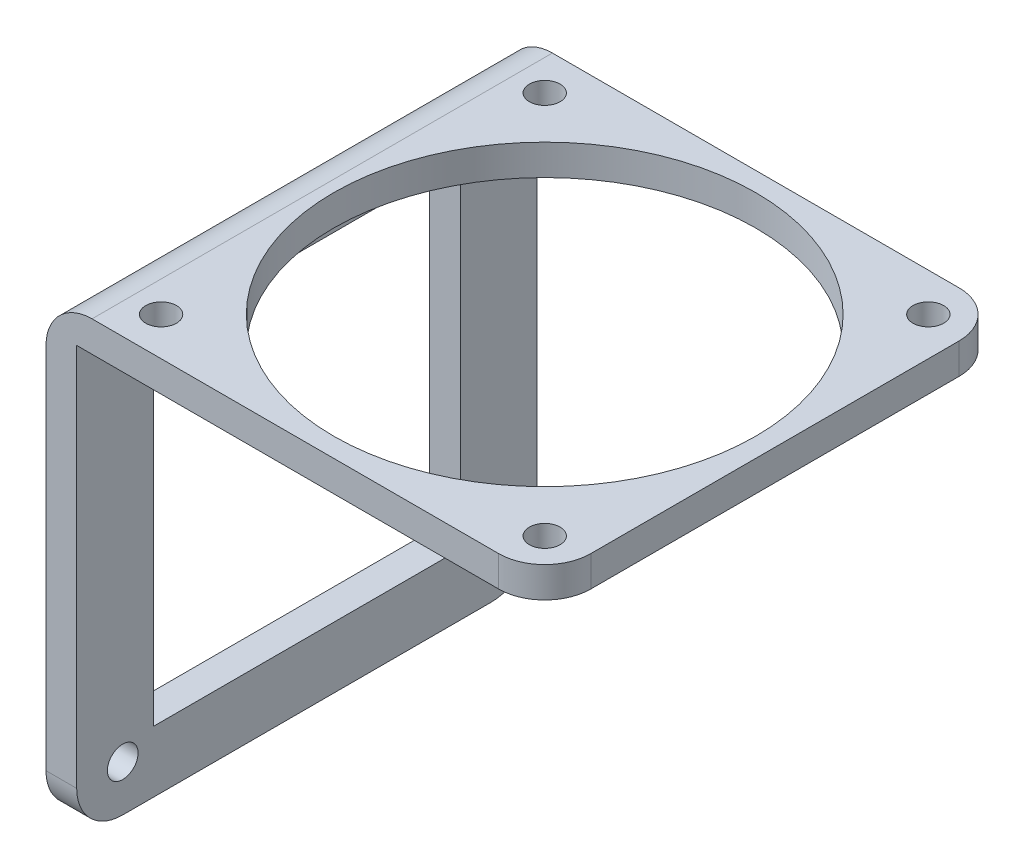
ISO-10303-21;
HEADER;
FILE_DESCRIPTION(('STEP AP214'),'2;1');
FILE_NAME('part.step','',(''),(''),'','','');
FILE_SCHEMA(('AUTOMOTIVE_DESIGN { 1 0 10303 214 1 1 1 1 }'));
ENDSEC;
DATA;
#1=APPLICATION_CONTEXT('core data for automotive mechanical design processes');
#2=APPLICATION_PROTOCOL_DEFINITION('international standard','automotive_design',2000,#1);
#3=PRODUCT_CONTEXT('',#1,'mechanical');
#4=PRODUCT('Part','Part','',(#3));
#5=PRODUCT_RELATED_PRODUCT_CATEGORY('part','',(#4));
#6=PRODUCT_DEFINITION_FORMATION('','',#4);
#7=PRODUCT_DEFINITION_CONTEXT('part definition',#1,'design');
#8=PRODUCT_DEFINITION('design','',#6,#7);
#9=PRODUCT_DEFINITION_SHAPE('','',#8);
#10=(LENGTH_UNIT() NAMED_UNIT(*) SI_UNIT(.MILLI.,.METRE.));
#11=(NAMED_UNIT(*) PLANE_ANGLE_UNIT() SI_UNIT($,.RADIAN.));
#12=(NAMED_UNIT(*) SI_UNIT($,.STERADIAN.) SOLID_ANGLE_UNIT());
#13=UNCERTAINTY_MEASURE_WITH_UNIT(LENGTH_MEASURE(1.E-05),#10,'distance_accuracy_value','');
#14=(GEOMETRIC_REPRESENTATION_CONTEXT(3) GLOBAL_UNCERTAINTY_ASSIGNED_CONTEXT((#13)) GLOBAL_UNIT_ASSIGNED_CONTEXT((#10,
#11,#12)) REPRESENTATION_CONTEXT('',''));
#15=CARTESIAN_POINT('',(0.,0.,0.));
#16=DIRECTION('',(0.,0.,1.));
#17=DIRECTION('',(1.,0.,0.));
#18=AXIS2_PLACEMENT_3D('',#15,#16,#17);
#19=CARTESIAN_POINT('',(0.,60.,60.));
#20=DIRECTION('',(1.,0.,0.));
#21=DIRECTION('',(0.,1.,0.));
#22=AXIS2_PLACEMENT_3D('',#19,#20,#21);
#23=PLANE('',#22);
#24=CARTESIAN_POINT('',(0.,6.,6.));
#25=DIRECTION('',(-1.,0.,0.));
#26=DIRECTION('',(0.,-1.,0.));
#27=AXIS2_PLACEMENT_3D('',#24,#25,#26);
#28=CIRCLE('',#27,2.);
#29=CARTESIAN_POINT('',(0.,4.,6.));
#30=VERTEX_POINT('',#29);
#31=EDGE_CURVE('E225',#30,#30,#28,.T.);
#32=ORIENTED_EDGE('',*,*,#31,.F.);
#33=EDGE_LOOP('',(#32));
#34=FACE_BOUND('',#33,.T.);
#35=CARTESIAN_POINT('',(0.,6.,54.));
#36=DIRECTION('',(-1.,0.,0.));
#37=DIRECTION('',(0.,-1.,0.));
#38=AXIS2_PLACEMENT_3D('',#35,#36,#37);
#39=CIRCLE('',#38,2.);
#40=CARTESIAN_POINT('',(0.,3.99999999999999,54.));
#41=VERTEX_POINT('',#40);
#42=EDGE_CURVE('E421',#41,#41,#39,.T.);
#43=ORIENTED_EDGE('',*,*,#42,.F.);
#44=EDGE_LOOP('',(#43));
#45=FACE_BOUND('',#44,.T.);
#46=DIRECTION('',(0.,0.,1.));
#47=VECTOR('',#46,1.);
#48=CARTESIAN_POINT('',(0.,8.,10.));
#49=LINE('',#48,#47);
#50=CARTESIAN_POINT('',(0.,8.,10.));
#51=VERTEX_POINT('',#50);
#52=CARTESIAN_POINT('',(0.,8.,50.));
#53=VERTEX_POINT('',#52);
#54=EDGE_CURVE('E157',#51,#53,#49,.T.);
#55=ORIENTED_EDGE('',*,*,#54,.F.);
#56=DIRECTION('',(0.,-1.,0.));
#57=VECTOR('',#56,1.);
#58=CARTESIAN_POINT('',(0.,8.,10.));
#59=LINE('',#58,#57);
#60=CARTESIAN_POINT('',(0.,51.9999999999998,10.));
#61=VERTEX_POINT('',#60);
#62=EDGE_CURVE('E162',#61,#51,#59,.T.);
#63=ORIENTED_EDGE('',*,*,#62,.F.);
#64=DIRECTION('',(0.,0.,-1.));
#65=VECTOR('',#64,1.);
#66=CARTESIAN_POINT('',(0.,51.9999999999998,10.));
#67=LINE('',#66,#65);
#68=CARTESIAN_POINT('',(0.,51.9999999999998,50.));
#69=VERTEX_POINT('',#68);
#70=EDGE_CURVE('E166',#69,#61,#67,.T.);
#71=ORIENTED_EDGE('',*,*,#70,.F.);
#72=DIRECTION('',(0.,1.,0.));
#73=VECTOR('',#72,1.);
#74=CARTESIAN_POINT('',(0.,8.,50.));
#75=LINE('',#74,#73);
#76=EDGE_CURVE('E146',#53,#69,#75,.T.);
#77=ORIENTED_EDGE('',*,*,#76,.F.);
#78=EDGE_LOOP('',(#55,#63,#71,#77));
#79=FACE_BOUND('',#78,.T.);
#80=DIRECTION('',(0.,-1.,0.));
#81=VECTOR('',#80,1.);
#82=CARTESIAN_POINT('',(0.,60.,60.));
#83=LINE('',#82,#81);
#84=CARTESIAN_POINT('',(0.,54.,60.));
#85=VERTEX_POINT('',#84);
#86=CARTESIAN_POINT('',(0.,6.,60.));
#87=VERTEX_POINT('',#86);
#88=EDGE_CURVE('E176',#85,#87,#83,.T.);
#89=ORIENTED_EDGE('',*,*,#88,.F.);
#90=DIRECTION('',(0.,0.,-1.));
#91=VECTOR('',#90,1.);
#92=CARTESIAN_POINT('',(0.,54.,60.));
#93=LINE('',#92,#91);
#94=CARTESIAN_POINT('',(0.,54.,0.));
#95=VERTEX_POINT('',#94);
#96=EDGE_CURVE('E261',#85,#95,#93,.T.);
#97=ORIENTED_EDGE('',*,*,#96,.T.);
#98=DIRECTION('',(0.,-1.,0.));
#99=VECTOR('',#98,1.);
#100=CARTESIAN_POINT('',(0.,60.,0.));
#101=LINE('',#100,#99);
#102=CARTESIAN_POINT('',(0.,6.,0.));
#103=VERTEX_POINT('',#102);
#104=EDGE_CURVE('E173',#95,#103,#101,.T.);
#105=ORIENTED_EDGE('',*,*,#104,.T.);
#106=CARTESIAN_POINT('',(0.,6.,6.));
#107=DIRECTION('',(1.,0.,0.));
#108=DIRECTION('',(0.,1.,0.));
#109=AXIS2_PLACEMENT_3D('',#106,#107,#108);
#110=CIRCLE('',#109,6.);
#111=CARTESIAN_POINT('',(0.,0.,6.));
#112=VERTEX_POINT('',#111);
#113=EDGE_CURVE('E257',#103,#112,#110,.F.);
#114=ORIENTED_EDGE('',*,*,#113,.T.);
#115=DIRECTION('',(0.,0.,-1.));
#116=VECTOR('',#115,1.);
#117=CARTESIAN_POINT('',(0.,0.,60.));
#118=LINE('',#117,#116);
#119=CARTESIAN_POINT('',(0.,0.,54.));
#120=VERTEX_POINT('',#119);
#121=EDGE_CURVE('E208',#120,#112,#118,.T.);
#122=ORIENTED_EDGE('',*,*,#121,.F.);
#123=CARTESIAN_POINT('',(0.,6.,54.));
#124=DIRECTION('',(1.,0.,0.));
#125=DIRECTION('',(0.,1.,0.));
#126=AXIS2_PLACEMENT_3D('',#123,#124,#125);
#127=CIRCLE('',#126,6.);
#128=EDGE_CURVE('E259',#120,#87,#127,.F.);
#129=ORIENTED_EDGE('',*,*,#128,.T.);
#130=EDGE_LOOP('',(#89,#97,#105,#114,#122,#129));
#131=FACE_BOUND('',#130,.T.);
#132=ADVANCED_FACE('F33',(#34,#45,#79,#131),#23,.F.);
#133=CARTESIAN_POINT('',(0.,0.,60.));
#134=DIRECTION('',(0.,1.,0.));
#135=DIRECTION('',(0.,0.,1.));
#136=AXIS2_PLACEMENT_3D('',#133,#134,#135);
#137=PLANE('',#136);
#138=DIRECTION('',(0.,0.,-1.));
#139=VECTOR('',#138,1.);
#140=CARTESIAN_POINT('',(4.,0.,60.));
#141=LINE('',#140,#139);
#142=CARTESIAN_POINT('',(4.,0.,54.));
#143=VERTEX_POINT('',#142);
#144=CARTESIAN_POINT('',(4.,0.,6.));
#145=VERTEX_POINT('',#144);
#146=EDGE_CURVE('E206',#143,#145,#141,.T.);
#147=ORIENTED_EDGE('',*,*,#146,.F.);
#148=DIRECTION('',(1.,0.,0.));
#149=VECTOR('',#148,1.);
#150=CARTESIAN_POINT('',(0.,0.,54.));
#151=LINE('',#150,#149);
#152=EDGE_CURVE('E11',#143,#120,#151,.F.);
#153=ORIENTED_EDGE('',*,*,#152,.T.);
#154=ORIENTED_EDGE('',*,*,#121,.T.);
#155=DIRECTION('',(1.,0.,0.));
#156=VECTOR('',#155,1.);
#157=CARTESIAN_POINT('',(0.,0.,6.));
#158=LINE('',#157,#156);
#159=EDGE_CURVE('E41',#112,#145,#158,.T.);
#160=ORIENTED_EDGE('',*,*,#159,.T.);
#161=EDGE_LOOP('',(#147,#153,#154,#160));
#162=FACE_BOUND('',#161,.T.);
#163=ADVANCED_FACE('F266',(#162),#137,.F.);
#164=CARTESIAN_POINT('',(4.,0.,60.));
#165=DIRECTION('',(-1.,0.,0.));
#166=DIRECTION('',(0.,0.,1.));
#167=AXIS2_PLACEMENT_3D('',#164,#165,#166);
#168=PLANE('',#167);
#169=CARTESIAN_POINT('',(4.,6.,6.));
#170=DIRECTION('',(-1.,0.,0.));
#171=DIRECTION('',(0.,0.,1.));
#172=AXIS2_PLACEMENT_3D('',#169,#170,#171);
#173=CIRCLE('',#172,2.);
#174=CARTESIAN_POINT('',(4.,6.,8.));
#175=VERTEX_POINT('',#174);
#176=EDGE_CURVE('E224',#175,#175,#173,.T.);
#177=ORIENTED_EDGE('',*,*,#176,.T.);
#178=EDGE_LOOP('',(#177));
#179=FACE_BOUND('',#178,.T.);
#180=CARTESIAN_POINT('',(4.,6.,54.));
#181=DIRECTION('',(-1.,0.,0.));
#182=DIRECTION('',(0.,0.,1.));
#183=AXIS2_PLACEMENT_3D('',#180,#181,#182);
#184=CIRCLE('',#183,2.);
#185=CARTESIAN_POINT('',(4.,6.,56.));
#186=VERTEX_POINT('',#185);
#187=EDGE_CURVE('E221',#186,#186,#184,.T.);
#188=ORIENTED_EDGE('',*,*,#187,.T.);
#189=EDGE_LOOP('',(#188));
#190=FACE_BOUND('',#189,.T.);
#191=DIRECTION('',(0.,0.,-1.));
#192=VECTOR('',#191,1.);
#193=CARTESIAN_POINT('',(4.,51.9999999999998,60.));
#194=LINE('',#193,#192);
#195=CARTESIAN_POINT('',(4.,51.9999999999998,50.));
#196=VERTEX_POINT('',#195);
#197=CARTESIAN_POINT('',(4.,51.9999999999998,10.));
#198=VERTEX_POINT('',#197);
#199=EDGE_CURVE('E214',#196,#198,#194,.T.);
#200=ORIENTED_EDGE('',*,*,#199,.T.);
#201=DIRECTION('',(0.,-1.,0.));
#202=VECTOR('',#201,1.);
#203=CARTESIAN_POINT('',(4.,0.,10.));
#204=LINE('',#203,#202);
#205=CARTESIAN_POINT('',(4.,8.,10.));
#206=VERTEX_POINT('',#205);
#207=EDGE_CURVE('E217',#198,#206,#204,.T.);
#208=ORIENTED_EDGE('',*,*,#207,.T.);
#209=DIRECTION('',(0.,0.,1.));
#210=VECTOR('',#209,1.);
#211=CARTESIAN_POINT('',(4.,8.,60.));
#212=LINE('',#211,#210);
#213=CARTESIAN_POINT('',(4.,8.,50.));
#214=VERTEX_POINT('',#213);
#215=EDGE_CURVE('E211',#206,#214,#212,.T.);
#216=ORIENTED_EDGE('',*,*,#215,.T.);
#217=DIRECTION('',(0.,1.,0.));
#218=VECTOR('',#217,1.);
#219=CARTESIAN_POINT('',(4.,0.,50.));
#220=LINE('',#219,#218);
#221=EDGE_CURVE('E149',#214,#196,#220,.T.);
#222=ORIENTED_EDGE('',*,*,#221,.T.);
#223=EDGE_LOOP('',(#200,#208,#216,#222));
#224=FACE_BOUND('',#223,.T.);
#225=DIRECTION('',(0.,1.,0.));
#226=VECTOR('',#225,1.);
#227=CARTESIAN_POINT('',(4.,0.,60.));
#228=LINE('',#227,#226);
#229=CARTESIAN_POINT('',(4.,6.,60.));
#230=VERTEX_POINT('',#229);
#231=CARTESIAN_POINT('',(4.,56.,60.));
#232=VERTEX_POINT('',#231);
#233=EDGE_CURVE('E179',#230,#232,#228,.T.);
#234=ORIENTED_EDGE('',*,*,#233,.F.);
#235=CARTESIAN_POINT('',(4.,6.,54.));
#236=DIRECTION('',(-1.,0.,0.));
#237=DIRECTION('',(0.,0.,1.));
#238=AXIS2_PLACEMENT_3D('',#235,#236,#237);
#239=CIRCLE('',#238,6.);
#240=EDGE_CURVE('E56',#230,#143,#239,.F.);
#241=ORIENTED_EDGE('',*,*,#240,.T.);
#242=ORIENTED_EDGE('',*,*,#146,.T.);
#243=CARTESIAN_POINT('',(4.,6.,6.));
#244=DIRECTION('',(-1.,0.,0.));
#245=DIRECTION('',(0.,0.,1.));
#246=AXIS2_PLACEMENT_3D('',#243,#244,#245);
#247=CIRCLE('',#246,6.);
#248=CARTESIAN_POINT('',(4.,6.,0.));
#249=VERTEX_POINT('',#248);
#250=EDGE_CURVE('E48',#145,#249,#247,.F.);
#251=ORIENTED_EDGE('',*,*,#250,.T.);
#252=DIRECTION('',(0.,1.,0.));
#253=VECTOR('',#252,1.);
#254=CARTESIAN_POINT('',(4.,0.,0.));
#255=LINE('',#254,#253);
#256=CARTESIAN_POINT('',(4.,56.,0.));
#257=VERTEX_POINT('',#256);
#258=EDGE_CURVE('E191',#249,#257,#255,.T.);
#259=ORIENTED_EDGE('',*,*,#258,.T.);
#260=DIRECTION('',(0.,0.,-1.));
#261=VECTOR('',#260,1.);
#262=CARTESIAN_POINT('',(4.,56.,60.));
#263=LINE('',#262,#261);
#264=EDGE_CURVE('E203',#232,#257,#263,.T.);
#265=ORIENTED_EDGE('',*,*,#264,.F.);
#266=EDGE_LOOP('',(#234,#241,#242,#251,#259,#265));
#267=FACE_BOUND('',#266,.T.);
#268=ADVANCED_FACE('F270',(#179,#190,#224,#267),#168,.F.);
#269=CARTESIAN_POINT('',(4.,56.,60.));
#270=DIRECTION('',(0.,1.,0.));
#271=DIRECTION('',(-1.,0.,0.));
#272=AXIS2_PLACEMENT_3D('',#269,#270,#271);
#273=PLANE('',#272);
#274=CARTESIAN_POINT('',(35.,55.9999999999999,30.));
#275=DIRECTION('',(0.,-1.,0.));
#276=DIRECTION('',(1.,0.,0.));
#277=AXIS2_PLACEMENT_3D('',#274,#275,#276);
#278=CIRCLE('',#277,27.5);
#279=CARTESIAN_POINT('',(62.5,55.9999999999998,30.));
#280=VERTEX_POINT('',#279);
#281=EDGE_CURVE('E228',#280,#280,#278,.T.);
#282=ORIENTED_EDGE('',*,*,#281,.F.);
#283=EDGE_LOOP('',(#282));
#284=FACE_BOUND('',#283,.T.);
#285=CARTESIAN_POINT('',(60.,55.9999999999998,55.));
#286=DIRECTION('',(0.,1.,0.));
#287=DIRECTION('',(-1.,0.,0.));
#288=AXIS2_PLACEMENT_3D('',#285,#286,#287);
#289=CIRCLE('',#288,2.);
#290=CARTESIAN_POINT('',(58.,55.9999999999998,55.));
#291=VERTEX_POINT('',#290);
#292=EDGE_CURVE('E398',#291,#291,#289,.F.);
#293=ORIENTED_EDGE('',*,*,#292,.F.);
#294=EDGE_LOOP('',(#293));
#295=FACE_BOUND('',#294,.T.);
#296=CARTESIAN_POINT('',(9.99999999999999,56.,5.));
#297=DIRECTION('',(0.,1.,0.));
#298=DIRECTION('',(-1.,0.,0.));
#299=AXIS2_PLACEMENT_3D('',#296,#297,#298);
#300=CIRCLE('',#299,2.00000000000001);
#301=CARTESIAN_POINT('',(7.99999999999998,56.,5.));
#302=VERTEX_POINT('',#301);
#303=EDGE_CURVE('E399',#302,#302,#300,.F.);
#304=ORIENTED_EDGE('',*,*,#303,.F.);
#305=EDGE_LOOP('',(#304));
#306=FACE_BOUND('',#305,.T.);
#307=CARTESIAN_POINT('',(9.99999999999999,56.,55.));
#308=DIRECTION('',(0.,1.,0.));
#309=DIRECTION('',(-1.,0.,0.));
#310=AXIS2_PLACEMENT_3D('',#307,#308,#309);
#311=CIRCLE('',#310,2.);
#312=CARTESIAN_POINT('',(7.99999999999999,56.,55.));
#313=VERTEX_POINT('',#312);
#314=EDGE_CURVE('E406',#313,#313,#311,.F.);
#315=ORIENTED_EDGE('',*,*,#314,.F.);
#316=EDGE_LOOP('',(#315));
#317=FACE_BOUND('',#316,.T.);
#318=CARTESIAN_POINT('',(60.,55.9999999999998,5.));
#319=DIRECTION('',(0.,1.,0.));
#320=DIRECTION('',(-1.,0.,0.));
#321=AXIS2_PLACEMENT_3D('',#318,#319,#320);
#322=CIRCLE('',#321,2.);
#323=CARTESIAN_POINT('',(58.,55.9999999999998,5.));
#324=VERTEX_POINT('',#323);
#325=EDGE_CURVE('E391',#324,#324,#322,.F.);
#326=ORIENTED_EDGE('',*,*,#325,.F.);
#327=EDGE_LOOP('',(#326));
#328=FACE_BOUND('',#327,.T.);
#329=DIRECTION('',(0.,0.,-1.));
#330=VECTOR('',#329,1.);
#331=CARTESIAN_POINT('',(65.,55.9999999999998,60.));
#332=LINE('',#331,#330);
#333=CARTESIAN_POINT('',(65.,55.9999999999998,54.));
#334=VERTEX_POINT('',#333);
#335=CARTESIAN_POINT('',(65.,55.9999999999998,6.));
#336=VERTEX_POINT('',#335);
#337=EDGE_CURVE('E200',#334,#336,#332,.T.);
#338=ORIENTED_EDGE('',*,*,#337,.F.);
#339=CARTESIAN_POINT('',(59.,55.9999999999998,54.));
#340=DIRECTION('',(0.,1.,0.));
#341=DIRECTION('',(-1.,0.,0.));
#342=AXIS2_PLACEMENT_3D('',#339,#340,#341);
#343=CIRCLE('',#342,6.);
#344=CARTESIAN_POINT('',(59.,55.9999999999998,60.));
#345=VERTEX_POINT('',#344);
#346=EDGE_CURVE('E249',#334,#345,#343,.F.);
#347=ORIENTED_EDGE('',*,*,#346,.T.);
#348=DIRECTION('',(1.,0.,0.));
#349=VECTOR('',#348,1.);
#350=CARTESIAN_POINT('',(4.,56.,60.));
#351=LINE('',#350,#349);
#352=EDGE_CURVE('E182',#232,#345,#351,.T.);
#353=ORIENTED_EDGE('',*,*,#352,.F.);
#354=ORIENTED_EDGE('',*,*,#264,.T.);
#355=DIRECTION('',(1.,0.,0.));
#356=VECTOR('',#355,1.);
#357=CARTESIAN_POINT('',(4.,56.,0.));
#358=LINE('',#357,#356);
#359=CARTESIAN_POINT('',(59.,55.9999999999998,0.));
#360=VERTEX_POINT('',#359);
#361=EDGE_CURVE('E193',#257,#360,#358,.T.);
#362=ORIENTED_EDGE('',*,*,#361,.T.);
#363=CARTESIAN_POINT('',(59.,55.9999999999998,6.));
#364=DIRECTION('',(0.,1.,0.));
#365=DIRECTION('',(-1.,0.,0.));
#366=AXIS2_PLACEMENT_3D('',#363,#364,#365);
#367=CIRCLE('',#366,6.);
#368=EDGE_CURVE('E247',#360,#336,#367,.F.);
#369=ORIENTED_EDGE('',*,*,#368,.T.);
#370=EDGE_LOOP('',(#338,#347,#353,#354,#362,#369));
#371=FACE_BOUND('',#370,.T.);
#372=ADVANCED_FACE('F297',(#284,#295,#306,#317,#328,#371),#273,.F.);
#373=CARTESIAN_POINT('',(65.,55.9999999999998,60.));
#374=DIRECTION('',(-1.,0.,0.));
#375=DIRECTION('',(0.,-1.,0.));
#376=AXIS2_PLACEMENT_3D('',#373,#374,#375);
#377=PLANE('',#376);
#378=DIRECTION('',(0.,0.,-1.));
#379=VECTOR('',#378,1.);
#380=CARTESIAN_POINT('',(65.,59.9999999999998,60.));
#381=LINE('',#380,#379);
#382=CARTESIAN_POINT('',(65.,59.9999999999998,54.));
#383=VERTEX_POINT('',#382);
#384=CARTESIAN_POINT('',(65.,59.9999999999998,6.));
#385=VERTEX_POINT('',#384);
#386=EDGE_CURVE('E188',#383,#385,#381,.T.);
#387=ORIENTED_EDGE('',*,*,#386,.F.);
#388=DIRECTION('',(0.,1.,0.));
#389=VECTOR('',#388,1.);
#390=CARTESIAN_POINT('',(65.,55.9999999999998,54.));
#391=LINE('',#390,#389);
#392=EDGE_CURVE('E245',#383,#334,#391,.F.);
#393=ORIENTED_EDGE('',*,*,#392,.T.);
#394=ORIENTED_EDGE('',*,*,#337,.T.);
#395=DIRECTION('',(0.,1.,0.));
#396=VECTOR('',#395,1.);
#397=CARTESIAN_POINT('',(65.,55.9999999999998,6.));
#398=LINE('',#397,#396);
#399=EDGE_CURVE('E242',#336,#385,#398,.T.);
#400=ORIENTED_EDGE('',*,*,#399,.T.);
#401=EDGE_LOOP('',(#387,#393,#394,#400));
#402=FACE_BOUND('',#401,.T.);
#403=ADVANCED_FACE('F305',(#402),#377,.F.);
#404=CARTESIAN_POINT('',(65.,59.9999999999998,60.));
#405=DIRECTION('',(0.,-1.,0.));
#406=DIRECTION('',(1.,0.,0.));
#407=AXIS2_PLACEMENT_3D('',#404,#405,#406);
#408=PLANE('',#407);
#409=CARTESIAN_POINT('',(35.,60.0000000000001,30.));
#410=DIRECTION('',(0.,-1.,0.));
#411=DIRECTION('',(1.,0.,0.));
#412=AXIS2_PLACEMENT_3D('',#409,#410,#411);
#413=CIRCLE('',#412,27.5);
#414=CARTESIAN_POINT('',(62.5,60.,30.));
#415=VERTEX_POINT('',#414);
#416=EDGE_CURVE('E416',#415,#415,#413,.T.);
#417=ORIENTED_EDGE('',*,*,#416,.T.);
#418=EDGE_LOOP('',(#417));
#419=FACE_BOUND('',#418,.T.);
#420=CARTESIAN_POINT('',(60.,59.9999999999998,55.));
#421=DIRECTION('',(0.,1.,0.));
#422=DIRECTION('',(-1.,0.,0.));
#423=AXIS2_PLACEMENT_3D('',#420,#421,#422);
#424=CIRCLE('',#423,2.);
#425=CARTESIAN_POINT('',(58.,59.9999999999998,55.));
#426=VERTEX_POINT('',#425);
#427=EDGE_CURVE('E402',#426,#426,#424,.T.);
#428=ORIENTED_EDGE('',*,*,#427,.F.);
#429=EDGE_LOOP('',(#428));
#430=FACE_BOUND('',#429,.T.);
#431=CARTESIAN_POINT('',(10.,60.,5.));
#432=DIRECTION('',(0.,1.,0.));
#433=DIRECTION('',(-1.,0.,0.));
#434=AXIS2_PLACEMENT_3D('',#431,#432,#433);
#435=CIRCLE('',#434,2.00000000000001);
#436=CARTESIAN_POINT('',(7.99999999999999,60.,5.));
#437=VERTEX_POINT('',#436);
#438=EDGE_CURVE('E403',#437,#437,#435,.T.);
#439=ORIENTED_EDGE('',*,*,#438,.F.);
#440=EDGE_LOOP('',(#439));
#441=FACE_BOUND('',#440,.T.);
#442=CARTESIAN_POINT('',(10.,60.,55.));
#443=DIRECTION('',(0.,1.,0.));
#444=DIRECTION('',(-1.,0.,0.));
#445=AXIS2_PLACEMENT_3D('',#442,#443,#444);
#446=CIRCLE('',#445,2.);
#447=CARTESIAN_POINT('',(8.,60.,55.));
#448=VERTEX_POINT('',#447);
#449=EDGE_CURVE('E413',#448,#448,#446,.T.);
#450=ORIENTED_EDGE('',*,*,#449,.F.);
#451=EDGE_LOOP('',(#450));
#452=FACE_BOUND('',#451,.T.);
#453=CARTESIAN_POINT('',(60.,59.9999999999998,5.));
#454=DIRECTION('',(0.,1.,0.));
#455=DIRECTION('',(-1.,0.,0.));
#456=AXIS2_PLACEMENT_3D('',#453,#454,#455);
#457=CIRCLE('',#456,2.);
#458=CARTESIAN_POINT('',(58.,59.9999999999998,5.));
#459=VERTEX_POINT('',#458);
#460=EDGE_CURVE('E393',#459,#459,#457,.T.);
#461=ORIENTED_EDGE('',*,*,#460,.F.);
#462=EDGE_LOOP('',(#461));
#463=FACE_BOUND('',#462,.T.);
#464=DIRECTION('',(-1.,0.,0.));
#465=VECTOR('',#464,1.);
#466=CARTESIAN_POINT('',(65.,59.9999999999998,60.));
#467=LINE('',#466,#465);
#468=CARTESIAN_POINT('',(59.,59.9999999999998,60.));
#469=VERTEX_POINT('',#468);
#470=CARTESIAN_POINT('',(6.00000000000002,60.,60.));
#471=VERTEX_POINT('',#470);
#472=EDGE_CURVE('E185',#469,#471,#467,.T.);
#473=ORIENTED_EDGE('',*,*,#472,.F.);
#474=CARTESIAN_POINT('',(59.,59.9999999999998,54.));
#475=DIRECTION('',(0.,-1.,0.));
#476=DIRECTION('',(1.,0.,0.));
#477=AXIS2_PLACEMENT_3D('',#474,#475,#476);
#478=CIRCLE('',#477,6.);
#479=EDGE_CURVE('E240',#469,#383,#478,.F.);
#480=ORIENTED_EDGE('',*,*,#479,.T.);
#481=ORIENTED_EDGE('',*,*,#386,.T.);
#482=CARTESIAN_POINT('',(59.,59.9999999999998,6.));
#483=DIRECTION('',(0.,-1.,0.));
#484=DIRECTION('',(1.,0.,0.));
#485=AXIS2_PLACEMENT_3D('',#482,#483,#484);
#486=CIRCLE('',#485,6.);
#487=CARTESIAN_POINT('',(59.,59.9999999999998,0.));
#488=VERTEX_POINT('',#487);
#489=EDGE_CURVE('E238',#385,#488,#486,.F.);
#490=ORIENTED_EDGE('',*,*,#489,.T.);
#491=DIRECTION('',(-1.,0.,0.));
#492=VECTOR('',#491,1.);
#493=CARTESIAN_POINT('',(65.,59.9999999999998,0.));
#494=LINE('',#493,#492);
#495=CARTESIAN_POINT('',(6.00000000000002,60.,0.));
#496=VERTEX_POINT('',#495);
#497=EDGE_CURVE('E180',#488,#496,#494,.T.);
#498=ORIENTED_EDGE('',*,*,#497,.T.);
#499=DIRECTION('',(0.,0.,-1.));
#500=VECTOR('',#499,1.);
#501=CARTESIAN_POINT('',(6.00000000000002,60.,60.));
#502=LINE('',#501,#500);
#503=EDGE_CURVE('E236',#496,#471,#502,.F.);
#504=ORIENTED_EDGE('',*,*,#503,.T.);
#505=EDGE_LOOP('',(#473,#480,#481,#490,#498,#504));
#506=FACE_BOUND('',#505,.T.);
#507=ADVANCED_FACE('F286',(#419,#430,#441,#452,#463,#506),#408,.F.);
#508=CARTESIAN_POINT('',(0.,0.,60.));
#509=DIRECTION('',(0.,0.,1.));
#510=DIRECTION('',(1.,0.,0.));
#511=AXIS2_PLACEMENT_3D('',#508,#509,#510);
#512=PLANE('',#511);
#513=ORIENTED_EDGE('',*,*,#352,.T.);
#514=DIRECTION('',(0.,1.,0.));
#515=VECTOR('',#514,1.);
#516=CARTESIAN_POINT('',(59.,59.9999999999998,60.));
#517=LINE('',#516,#515);
#518=EDGE_CURVE('E233',#345,#469,#517,.T.);
#519=ORIENTED_EDGE('',*,*,#518,.T.);
#520=ORIENTED_EDGE('',*,*,#472,.T.);
#521=CARTESIAN_POINT('',(6.,54.,60.));
#522=DIRECTION('',(0.,0.,1.));
#523=DIRECTION('',(1.,0.,0.));
#524=AXIS2_PLACEMENT_3D('',#521,#522,#523);
#525=CIRCLE('',#524,6.);
#526=EDGE_CURVE('E231',#471,#85,#525,.T.);
#527=ORIENTED_EDGE('',*,*,#526,.T.);
#528=ORIENTED_EDGE('',*,*,#88,.T.);
#529=DIRECTION('',(1.,0.,0.));
#530=VECTOR('',#529,1.);
#531=CARTESIAN_POINT('',(4.,6.,60.));
#532=LINE('',#531,#530);
#533=EDGE_CURVE('E220',#87,#230,#532,.T.);
#534=ORIENTED_EDGE('',*,*,#533,.T.);
#535=ORIENTED_EDGE('',*,*,#233,.T.);
#536=EDGE_LOOP('',(#513,#519,#520,#527,#528,#534,#535));
#537=FACE_BOUND('',#536,.T.);
#538=ADVANCED_FACE('F290',(#537),#512,.T.);
#539=CARTESIAN_POINT('',(0.,0.,0.));
#540=DIRECTION('',(0.,0.,1.));
#541=DIRECTION('',(1.,0.,0.));
#542=AXIS2_PLACEMENT_3D('',#539,#540,#541);
#543=PLANE('',#542);
#544=ORIENTED_EDGE('',*,*,#497,.F.);
#545=DIRECTION('',(0.,1.,0.));
#546=VECTOR('',#545,1.);
#547=CARTESIAN_POINT('',(58.9999999999998,-2.04697370165263E-13,0.));
#548=LINE('',#547,#546);
#549=EDGE_CURVE('E255',#488,#360,#548,.F.);
#550=ORIENTED_EDGE('',*,*,#549,.T.);
#551=ORIENTED_EDGE('',*,*,#361,.F.);
#552=ORIENTED_EDGE('',*,*,#258,.F.);
#553=DIRECTION('',(1.,0.,0.));
#554=VECTOR('',#553,1.);
#555=CARTESIAN_POINT('',(0.,6.,0.));
#556=LINE('',#555,#554);
#557=EDGE_CURVE('E251',#249,#103,#556,.F.);
#558=ORIENTED_EDGE('',*,*,#557,.T.);
#559=ORIENTED_EDGE('',*,*,#104,.F.);
#560=CARTESIAN_POINT('',(6.,54.,0.));
#561=DIRECTION('',(0.,0.,1.));
#562=DIRECTION('',(1.,0.,0.));
#563=AXIS2_PLACEMENT_3D('',#560,#561,#562);
#564=CIRCLE('',#563,6.);
#565=EDGE_CURVE('E253',#95,#496,#564,.F.);
#566=ORIENTED_EDGE('',*,*,#565,.T.);
#567=EDGE_LOOP('',(#544,#550,#551,#552,#558,#559,#566));
#568=FACE_BOUND('',#567,.T.);
#569=ADVANCED_FACE('F276',(#568),#543,.F.);
#570=CARTESIAN_POINT('',(65.,8.,10.));
#571=DIRECTION('',(0.,0.,-1.));
#572=DIRECTION('',(-1.,0.,0.));
#573=AXIS2_PLACEMENT_3D('',#570,#571,#572);
#574=PLANE('',#573);
#575=DIRECTION('',(-1.,0.,0.));
#576=VECTOR('',#575,1.);
#577=CARTESIAN_POINT('',(65.,51.9999999999998,10.));
#578=LINE('',#577,#576);
#579=EDGE_CURVE('E171',#198,#61,#578,.T.);
#580=ORIENTED_EDGE('',*,*,#579,.T.);
#581=ORIENTED_EDGE('',*,*,#62,.T.);
#582=DIRECTION('',(-1.,0.,0.));
#583=VECTOR('',#582,1.);
#584=CARTESIAN_POINT('',(65.,8.,10.));
#585=LINE('',#584,#583);
#586=EDGE_CURVE('E153',#206,#51,#585,.T.);
#587=ORIENTED_EDGE('',*,*,#586,.F.);
#588=ORIENTED_EDGE('',*,*,#207,.F.);
#589=EDGE_LOOP('',(#580,#581,#587,#588));
#590=FACE_BOUND('',#589,.T.);
#591=ADVANCED_FACE('F342',(#590),#574,.F.);
#592=CARTESIAN_POINT('',(65.,51.9999999999998,10.));
#593=DIRECTION('',(0.,1.,0.));
#594=DIRECTION('',(-1.,0.,0.));
#595=AXIS2_PLACEMENT_3D('',#592,#593,#594);
#596=PLANE('',#595);
#597=DIRECTION('',(-1.,0.,0.));
#598=VECTOR('',#597,1.);
#599=CARTESIAN_POINT('',(65.,51.9999999999998,50.));
#600=LINE('',#599,#598);
#601=EDGE_CURVE('E152',#196,#69,#600,.T.);
#602=ORIENTED_EDGE('',*,*,#601,.T.);
#603=ORIENTED_EDGE('',*,*,#70,.T.);
#604=ORIENTED_EDGE('',*,*,#579,.F.);
#605=ORIENTED_EDGE('',*,*,#199,.F.);
#606=EDGE_LOOP('',(#602,#603,#604,#605));
#607=FACE_BOUND('',#606,.T.);
#608=ADVANCED_FACE('F347',(#607),#596,.F.);
#609=CARTESIAN_POINT('',(65.,8.,50.));
#610=DIRECTION('',(0.,0.,1.));
#611=DIRECTION('',(1.,0.,0.));
#612=AXIS2_PLACEMENT_3D('',#609,#610,#611);
#613=PLANE('',#612);
#614=DIRECTION('',(-1.,0.,0.));
#615=VECTOR('',#614,1.);
#616=CARTESIAN_POINT('',(65.,8.,50.));
#617=LINE('',#616,#615);
#618=EDGE_CURVE('E141',#214,#53,#617,.T.);
#619=ORIENTED_EDGE('',*,*,#618,.T.);
#620=ORIENTED_EDGE('',*,*,#76,.T.);
#621=ORIENTED_EDGE('',*,*,#601,.F.);
#622=ORIENTED_EDGE('',*,*,#221,.F.);
#623=EDGE_LOOP('',(#619,#620,#621,#622));
#624=FACE_BOUND('',#623,.T.);
#625=ADVANCED_FACE('F143',(#624),#613,.F.);
#626=CARTESIAN_POINT('',(65.,8.,10.));
#627=DIRECTION('',(0.,-1.,0.));
#628=DIRECTION('',(1.,0.,0.));
#629=AXIS2_PLACEMENT_3D('',#626,#627,#628);
#630=PLANE('',#629);
#631=ORIENTED_EDGE('',*,*,#586,.T.);
#632=ORIENTED_EDGE('',*,*,#54,.T.);
#633=ORIENTED_EDGE('',*,*,#618,.F.);
#634=ORIENTED_EDGE('',*,*,#215,.F.);
#635=EDGE_LOOP('',(#631,#632,#633,#634));
#636=FACE_BOUND('',#635,.T.);
#637=ADVANCED_FACE('F158',(#636),#630,.F.);
#638=CARTESIAN_POINT('',(59.9999999999998,-0.00100000000018835,5.));
#639=DIRECTION('',(0.,1.,0.));
#640=DIRECTION('',(-1.,0.,0.));
#641=AXIS2_PLACEMENT_3D('',#638,#639,#640);
#642=CYLINDRICAL_SURFACE('',#641,2.);
#643=ORIENTED_EDGE('',*,*,#460,.T.);
#644=EDGE_LOOP('',(#643));
#645=FACE_BOUND('',#644,.T.);
#646=ORIENTED_EDGE('',*,*,#325,.T.);
#647=EDGE_LOOP('',(#646));
#648=FACE_BOUND('',#647,.T.);
#649=ADVANCED_FACE('F351',(#645,#648),#642,.F.);
#650=CARTESIAN_POINT('',(9.99999999999981,-0.00100000000003569,55.));
#651=DIRECTION('',(0.,1.,0.));
#652=DIRECTION('',(-1.,0.,0.));
#653=AXIS2_PLACEMENT_3D('',#650,#651,#652);
#654=CYLINDRICAL_SURFACE('',#653,2.);
#655=ORIENTED_EDGE('',*,*,#449,.T.);
#656=EDGE_LOOP('',(#655));
#657=FACE_BOUND('',#656,.T.);
#658=ORIENTED_EDGE('',*,*,#314,.T.);
#659=EDGE_LOOP('',(#658));
#660=FACE_BOUND('',#659,.T.);
#661=ADVANCED_FACE('F359',(#657,#660),#654,.F.);
#662=CARTESIAN_POINT('',(9.99999999999981,-0.00100000000003569,5.));
#663=DIRECTION('',(0.,1.,0.));
#664=DIRECTION('',(-1.,0.,0.));
#665=AXIS2_PLACEMENT_3D('',#662,#663,#664);
#666=CYLINDRICAL_SURFACE('',#665,2.00000000000001);
#667=ORIENTED_EDGE('',*,*,#438,.T.);
#668=EDGE_LOOP('',(#667));
#669=FACE_BOUND('',#668,.T.);
#670=ORIENTED_EDGE('',*,*,#303,.T.);
#671=EDGE_LOOP('',(#670));
#672=FACE_BOUND('',#671,.T.);
#673=ADVANCED_FACE('F361',(#669,#672),#666,.F.);
#674=CARTESIAN_POINT('',(59.9999999999998,-0.00100000000018835,55.));
#675=DIRECTION('',(0.,1.,0.));
#676=DIRECTION('',(-1.,0.,0.));
#677=AXIS2_PLACEMENT_3D('',#674,#675,#676);
#678=CYLINDRICAL_SURFACE('',#677,2.);
#679=ORIENTED_EDGE('',*,*,#427,.T.);
#680=EDGE_LOOP('',(#679));
#681=FACE_BOUND('',#680,.T.);
#682=ORIENTED_EDGE('',*,*,#292,.T.);
#683=EDGE_LOOP('',(#682));
#684=FACE_BOUND('',#683,.T.);
#685=ADVANCED_FACE('F364',(#681,#684),#678,.F.);
#686=CARTESIAN_POINT('',(35.,60.0000000000001,30.));
#687=DIRECTION('',(0.,-1.,0.));
#688=DIRECTION('',(1.,0.,0.));
#689=AXIS2_PLACEMENT_3D('',#686,#687,#688);
#690=CYLINDRICAL_SURFACE('',#689,27.5);
#691=ORIENTED_EDGE('',*,*,#416,.F.);
#692=EDGE_LOOP('',(#691));
#693=FACE_BOUND('',#692,.T.);
#694=ORIENTED_EDGE('',*,*,#281,.T.);
#695=EDGE_LOOP('',(#694));
#696=FACE_BOUND('',#695,.T.);
#697=ADVANCED_FACE('F368',(#693,#696),#690,.F.);
#698=CARTESIAN_POINT('',(10.,6.,54.));
#699=DIRECTION('',(-1.,0.,0.));
#700=DIRECTION('',(0.,-1.,0.));
#701=AXIS2_PLACEMENT_3D('',#698,#699,#700);
#702=CYLINDRICAL_SURFACE('',#701,2.);
#703=ORIENTED_EDGE('',*,*,#42,.T.);
#704=EDGE_LOOP('',(#703));
#705=FACE_BOUND('',#704,.T.);
#706=ORIENTED_EDGE('',*,*,#187,.F.);
#707=EDGE_LOOP('',(#706));
#708=FACE_BOUND('',#707,.T.);
#709=ADVANCED_FACE('F375',(#705,#708),#702,.F.);
#710=CARTESIAN_POINT('',(10.,6.,6.));
#711=DIRECTION('',(-1.,0.,0.));
#712=DIRECTION('',(0.,-1.,0.));
#713=AXIS2_PLACEMENT_3D('',#710,#711,#712);
#714=CYLINDRICAL_SURFACE('',#713,2.);
#715=ORIENTED_EDGE('',*,*,#31,.T.);
#716=EDGE_LOOP('',(#715));
#717=FACE_BOUND('',#716,.T.);
#718=ORIENTED_EDGE('',*,*,#176,.F.);
#719=EDGE_LOOP('',(#718));
#720=FACE_BOUND('',#719,.T.);
#721=ADVANCED_FACE('F317',(#717,#720),#714,.F.);
#722=CARTESIAN_POINT('',(58.9999999999998,-2.04697370165263E-13,54.));
#723=DIRECTION('',(0.,-1.,0.));
#724=DIRECTION('',(1.,0.,0.));
#725=AXIS2_PLACEMENT_3D('',#722,#723,#724);
#726=CYLINDRICAL_SURFACE('',#725,6.);
#727=ORIENTED_EDGE('',*,*,#346,.F.);
#728=ORIENTED_EDGE('',*,*,#392,.F.);
#729=ORIENTED_EDGE('',*,*,#479,.F.);
#730=ORIENTED_EDGE('',*,*,#518,.F.);
#731=EDGE_LOOP('',(#727,#728,#729,#730));
#732=FACE_BOUND('',#731,.T.);
#733=ADVANCED_FACE('F301',(#732),#726,.T.);
#734=CARTESIAN_POINT('',(59.,55.9999999999998,6.));
#735=DIRECTION('',(0.,1.,0.));
#736=DIRECTION('',(-1.,0.,0.));
#737=AXIS2_PLACEMENT_3D('',#734,#735,#736);
#738=CYLINDRICAL_SURFACE('',#737,6.);
#739=ORIENTED_EDGE('',*,*,#368,.F.);
#740=ORIENTED_EDGE('',*,*,#549,.F.);
#741=ORIENTED_EDGE('',*,*,#489,.F.);
#742=ORIENTED_EDGE('',*,*,#399,.F.);
#743=EDGE_LOOP('',(#739,#740,#741,#742));
#744=FACE_BOUND('',#743,.T.);
#745=ADVANCED_FACE('F309',(#744),#738,.T.);
#746=CARTESIAN_POINT('',(6.,54.,60.));
#747=DIRECTION('',(0.,0.,-1.));
#748=DIRECTION('',(-1.,0.,0.));
#749=AXIS2_PLACEMENT_3D('',#746,#747,#748);
#750=CYLINDRICAL_SURFACE('',#749,6.);
#751=ORIENTED_EDGE('',*,*,#526,.F.);
#752=ORIENTED_EDGE('',*,*,#503,.F.);
#753=ORIENTED_EDGE('',*,*,#565,.F.);
#754=ORIENTED_EDGE('',*,*,#96,.F.);
#755=EDGE_LOOP('',(#751,#752,#753,#754));
#756=FACE_BOUND('',#755,.T.);
#757=ADVANCED_FACE('F288',(#756),#750,.T.);
#758=CARTESIAN_POINT('',(0.,6.,54.));
#759=DIRECTION('',(-1.,0.,0.));
#760=DIRECTION('',(0.,0.,1.));
#761=AXIS2_PLACEMENT_3D('',#758,#759,#760);
#762=CYLINDRICAL_SURFACE('',#761,6.);
#763=ORIENTED_EDGE('',*,*,#128,.F.);
#764=ORIENTED_EDGE('',*,*,#152,.F.);
#765=ORIENTED_EDGE('',*,*,#240,.F.);
#766=ORIENTED_EDGE('',*,*,#533,.F.);
#767=EDGE_LOOP('',(#763,#764,#765,#766));
#768=FACE_BOUND('',#767,.T.);
#769=ADVANCED_FACE('F293',(#768),#762,.T.);
#770=CARTESIAN_POINT('',(0.,6.,6.));
#771=DIRECTION('',(1.,0.,0.));
#772=DIRECTION('',(0.,0.,-1.));
#773=AXIS2_PLACEMENT_3D('',#770,#771,#772);
#774=CYLINDRICAL_SURFACE('',#773,6.);
#775=ORIENTED_EDGE('',*,*,#113,.F.);
#776=ORIENTED_EDGE('',*,*,#557,.F.);
#777=ORIENTED_EDGE('',*,*,#250,.F.);
#778=ORIENTED_EDGE('',*,*,#159,.F.);
#779=EDGE_LOOP('',(#775,#776,#777,#778));
#780=FACE_BOUND('',#779,.T.);
#781=ADVANCED_FACE('F35',(#780),#774,.T.);
#782=CLOSED_SHELL('',(#132,#163,#268,#372,#403,#507,#538,#569,#591,#608,#625,#637,#649,#661,
#673,#685,#697,#709,#721,#733,#745,#757,#769,#781));
#783=MANIFOLD_SOLID_BREP('B2',#782);
#784=ADVANCED_BREP_SHAPE_REPRESENTATION('',(#18,#783),#14);
#785=SHAPE_DEFINITION_REPRESENTATION(#9,#784);
ENDSEC;
END-ISO-10303-21;
